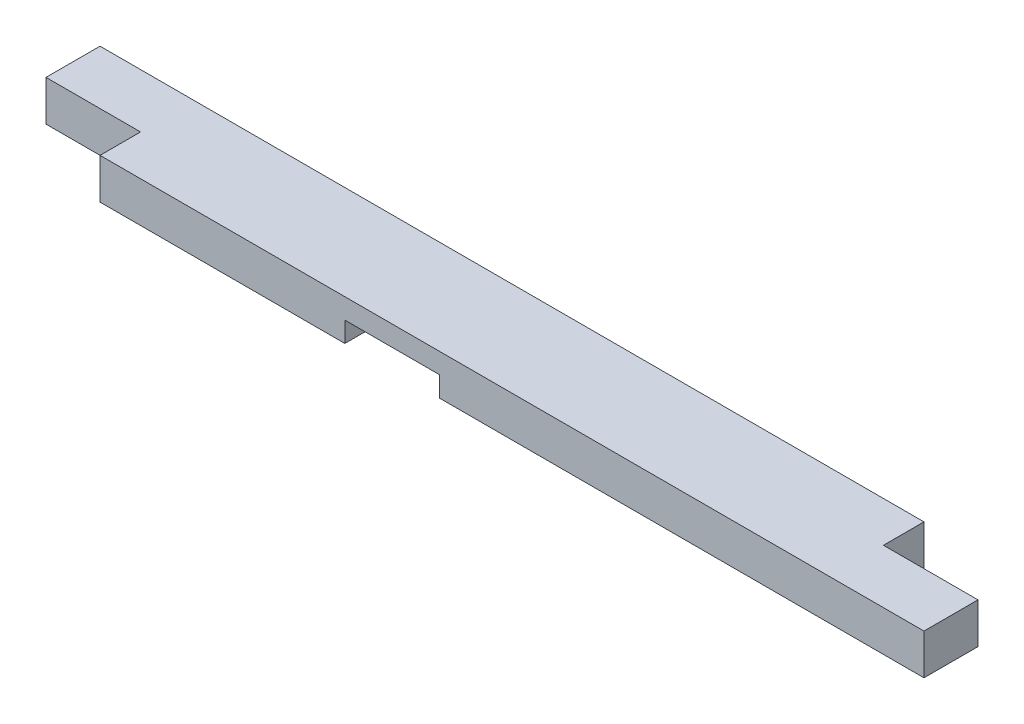
ISO-10303-21;
HEADER;
FILE_DESCRIPTION(('STEP AP214'),'2;1');
FILE_NAME('part.step','',(''),(''),'','','');
FILE_SCHEMA(('AUTOMOTIVE_DESIGN { 1 0 10303 214 1 1 1 1 }'));
ENDSEC;
DATA;
#1=APPLICATION_CONTEXT('core data for automotive mechanical design processes');
#2=APPLICATION_PROTOCOL_DEFINITION('international standard','automotive_design',2000,#1);
#3=PRODUCT_CONTEXT('',#1,'mechanical');
#4=PRODUCT('Part','Part','',(#3));
#5=PRODUCT_RELATED_PRODUCT_CATEGORY('part','',(#4));
#6=PRODUCT_DEFINITION_FORMATION('','',#4);
#7=PRODUCT_DEFINITION_CONTEXT('part definition',#1,'design');
#8=PRODUCT_DEFINITION('design','',#6,#7);
#9=PRODUCT_DEFINITION_SHAPE('','',#8);
#10=(LENGTH_UNIT() NAMED_UNIT(*) SI_UNIT(.MILLI.,.METRE.));
#11=(NAMED_UNIT(*) PLANE_ANGLE_UNIT() SI_UNIT($,.RADIAN.));
#12=(NAMED_UNIT(*) SI_UNIT($,.STERADIAN.) SOLID_ANGLE_UNIT());
#13=UNCERTAINTY_MEASURE_WITH_UNIT(LENGTH_MEASURE(1.E-05),#10,'distance_accuracy_value','');
#14=(GEOMETRIC_REPRESENTATION_CONTEXT(3) GLOBAL_UNCERTAINTY_ASSIGNED_CONTEXT((#13)) GLOBAL_UNIT_ASSIGNED_CONTEXT((#10,
#11,#12)) REPRESENTATION_CONTEXT('',''));
#15=CARTESIAN_POINT('',(0.,0.,0.));
#16=DIRECTION('',(0.,0.,1.));
#17=DIRECTION('',(1.,0.,0.));
#18=AXIS2_PLACEMENT_3D('',#15,#16,#17);
#19=CARTESIAN_POINT('',(0.,0.,0.));
#20=DIRECTION('',(0.,-1.,0.));
#21=DIRECTION('',(0.,0.,-1.));
#22=AXIS2_PLACEMENT_3D('',#19,#20,#21);
#23=PLANE('',#22);
#24=DIRECTION('',(-1.,0.,0.));
#25=VECTOR('',#24,1.);
#26=CARTESIAN_POINT('',(0.,0.,-38.1));
#27=LINE('',#26,#25);
#28=CARTESIAN_POINT('',(88.9,0.,-38.1));
#29=VERTEX_POINT('',#28);
#30=CARTESIAN_POINT('',(0.,0.,-38.1));
#31=VERTEX_POINT('',#30);
#32=EDGE_CURVE('E160',#29,#31,#27,.T.);
#33=ORIENTED_EDGE('',*,*,#32,.T.);
#34=DIRECTION('',(0.,0.,1.));
#35=VECTOR('',#34,1.);
#36=CARTESIAN_POINT('',(0.,0.,0.));
#37=LINE('',#36,#35);
#38=CARTESIAN_POINT('',(0.,0.,-88.9));
#39=VERTEX_POINT('',#38);
#40=EDGE_CURVE('E192',#39,#31,#37,.T.);
#41=ORIENTED_EDGE('',*,*,#40,.F.);
#42=DIRECTION('',(-1.,0.,0.));
#43=VECTOR('',#42,1.);
#44=CARTESIAN_POINT('',(0.,0.,-88.9));
#45=LINE('',#44,#43);
#46=CARTESIAN_POINT('',(319.0875,0.,-88.9));
#47=VERTEX_POINT('',#46);
#48=EDGE_CURVE('E218',#47,#39,#45,.T.);
#49=ORIENTED_EDGE('',*,*,#48,.F.);
#50=DIRECTION('',(0.,0.,-1.));
#51=VECTOR('',#50,1.);
#52=CARTESIAN_POINT('',(319.0875,0.,0.));
#53=LINE('',#52,#51);
#54=CARTESIAN_POINT('',(319.0875,0.,0.));
#55=VERTEX_POINT('',#54);
#56=EDGE_CURVE('E169',#55,#47,#53,.T.);
#57=ORIENTED_EDGE('',*,*,#56,.F.);
#58=DIRECTION('',(1.,0.,0.));
#59=VECTOR('',#58,1.);
#60=CARTESIAN_POINT('',(0.,0.,0.));
#61=LINE('',#60,#59);
#62=CARTESIAN_POINT('',(88.9,0.,0.));
#63=VERTEX_POINT('',#62);
#64=EDGE_CURVE('E214',#63,#55,#61,.T.);
#65=ORIENTED_EDGE('',*,*,#64,.F.);
#66=DIRECTION('',(0.,0.,-1.));
#67=VECTOR('',#66,1.);
#68=CARTESIAN_POINT('',(88.9,0.,0.));
#69=LINE('',#68,#67);
#70=EDGE_CURVE('E157',#63,#29,#69,.T.);
#71=ORIENTED_EDGE('',*,*,#70,.T.);
#72=EDGE_LOOP('',(#33,#41,#49,#57,#65,#71));
#73=FACE_BOUND('',#72,.T.);
#74=ADVANCED_FACE('F39',(#73),#23,.T.);
#75=CARTESIAN_POINT('',(0.,38.1,0.));
#76=DIRECTION('',(1.,0.,0.));
#77=DIRECTION('',(0.,0.,-1.));
#78=AXIS2_PLACEMENT_3D('',#75,#76,#77);
#79=PLANE('',#78);
#80=ORIENTED_EDGE('',*,*,#40,.T.);
#81=DIRECTION('',(0.,1.,0.));
#82=VECTOR('',#81,1.);
#83=CARTESIAN_POINT('',(0.,0.,-38.1));
#84=LINE('',#83,#82);
#85=CARTESIAN_POINT('',(0.,38.1,-38.1));
#86=VERTEX_POINT('',#85);
#87=EDGE_CURVE('E166',#31,#86,#84,.T.);
#88=ORIENTED_EDGE('',*,*,#87,.T.);
#89=DIRECTION('',(0.,0.,1.));
#90=VECTOR('',#89,1.);
#91=CARTESIAN_POINT('',(0.,38.1,0.));
#92=LINE('',#91,#90);
#93=CARTESIAN_POINT('',(0.,38.1,-88.9));
#94=VERTEX_POINT('',#93);
#95=EDGE_CURVE('E201',#94,#86,#92,.T.);
#96=ORIENTED_EDGE('',*,*,#95,.F.);
#97=DIRECTION('',(0.,-1.,0.));
#98=VECTOR('',#97,1.);
#99=CARTESIAN_POINT('',(0.,38.1,-88.9));
#100=LINE('',#99,#98);
#101=EDGE_CURVE('E47',#94,#39,#100,.T.);
#102=ORIENTED_EDGE('',*,*,#101,.T.);
#103=EDGE_LOOP('',(#80,#88,#96,#102));
#104=FACE_BOUND('',#103,.T.);
#105=ADVANCED_FACE('F41',(#104),#79,.F.);
#106=CARTESIAN_POINT('',(0.,38.1,0.));
#107=DIRECTION('',(0.,0.,-1.));
#108=DIRECTION('',(-1.,0.,0.));
#109=AXIS2_PLACEMENT_3D('',#106,#107,#108);
#110=PLANE('',#109);
#111=DIRECTION('',(1.,0.,0.));
#112=VECTOR('',#111,1.);
#113=CARTESIAN_POINT('',(0.,38.1,0.));
#114=LINE('',#113,#112);
#115=CARTESIAN_POINT('',(88.9,38.1,0.));
#116=VERTEX_POINT('',#115);
#117=CARTESIAN_POINT('',(863.6,38.1,0.));
#118=VERTEX_POINT('',#117);
#119=EDGE_CURVE('E204',#116,#118,#114,.T.);
#120=ORIENTED_EDGE('',*,*,#119,.F.);
#121=DIRECTION('',(0.,1.,0.));
#122=VECTOR('',#121,1.);
#123=CARTESIAN_POINT('',(88.9,0.,0.));
#124=LINE('',#123,#122);
#125=EDGE_CURVE('E62',#63,#116,#124,.T.);
#126=ORIENTED_EDGE('',*,*,#125,.F.);
#127=ORIENTED_EDGE('',*,*,#64,.T.);
#128=DIRECTION('',(0.,-1.,0.));
#129=VECTOR('',#128,1.);
#130=CARTESIAN_POINT('',(319.0875,19.05,0.));
#131=LINE('',#130,#129);
#132=CARTESIAN_POINT('',(319.0875,19.05,0.));
#133=VERTEX_POINT('',#132);
#134=EDGE_CURVE('E189',#133,#55,#131,.T.);
#135=ORIENTED_EDGE('',*,*,#134,.F.);
#136=DIRECTION('',(-1.,0.,0.));
#137=VECTOR('',#136,1.);
#138=CARTESIAN_POINT('',(319.0875,19.05,0.));
#139=LINE('',#138,#137);
#140=CARTESIAN_POINT('',(407.9875,19.05,0.));
#141=VERTEX_POINT('',#140);
#142=EDGE_CURVE('E183',#141,#133,#139,.T.);
#143=ORIENTED_EDGE('',*,*,#142,.F.);
#144=DIRECTION('',(0.,-1.,0.));
#145=VECTOR('',#144,1.);
#146=CARTESIAN_POINT('',(407.9875,19.05,0.));
#147=LINE('',#146,#145);
#148=CARTESIAN_POINT('',(407.9875,0.,0.));
#149=VERTEX_POINT('',#148);
#150=EDGE_CURVE('E193',#141,#149,#147,.T.);
#151=ORIENTED_EDGE('',*,*,#150,.T.);
#152=CARTESIAN_POINT('',(863.6,0.,0.));
#153=VERTEX_POINT('',#152);
#154=EDGE_CURVE('E213',#149,#153,#61,.T.);
#155=ORIENTED_EDGE('',*,*,#154,.T.);
#156=DIRECTION('',(0.,-1.,0.));
#157=VECTOR('',#156,1.);
#158=CARTESIAN_POINT('',(863.6,38.1,0.));
#159=LINE('',#158,#157);
#160=EDGE_CURVE('E11',#118,#153,#159,.T.);
#161=ORIENTED_EDGE('',*,*,#160,.F.);
#162=EDGE_LOOP('',(#120,#126,#127,#135,#143,#151,#155,#161));
#163=FACE_BOUND('',#162,.T.);
#164=ADVANCED_FACE('F245',(#163),#110,.F.);
#165=CARTESIAN_POINT('',(863.6,38.1,0.));
#166=DIRECTION('',(-1.,0.,0.));
#167=DIRECTION('',(0.,0.,1.));
#168=AXIS2_PLACEMENT_3D('',#165,#166,#167);
#169=PLANE('',#168);
#170=DIRECTION('',(0.,0.,-1.));
#171=VECTOR('',#170,1.);
#172=CARTESIAN_POINT('',(863.6,0.,0.));
#173=LINE('',#172,#171);
#174=CARTESIAN_POINT('',(863.6,0.,-50.8));
#175=VERTEX_POINT('',#174);
#176=EDGE_CURVE('E216',#153,#175,#173,.T.);
#177=ORIENTED_EDGE('',*,*,#176,.T.);
#178=DIRECTION('',(0.,1.,0.));
#179=VECTOR('',#178,1.);
#180=CARTESIAN_POINT('',(863.6,0.,-50.8));
#181=LINE('',#180,#179);
#182=CARTESIAN_POINT('',(863.6,38.1,-50.8));
#183=VERTEX_POINT('',#182);
#184=EDGE_CURVE('E54',#175,#183,#181,.T.);
#185=ORIENTED_EDGE('',*,*,#184,.T.);
#186=DIRECTION('',(0.,0.,-1.));
#187=VECTOR('',#186,1.);
#188=CARTESIAN_POINT('',(863.6,38.1,0.));
#189=LINE('',#188,#187);
#190=EDGE_CURVE('E206',#118,#183,#189,.T.);
#191=ORIENTED_EDGE('',*,*,#190,.F.);
#192=ORIENTED_EDGE('',*,*,#160,.T.);
#193=EDGE_LOOP('',(#177,#185,#191,#192));
#194=FACE_BOUND('',#193,.T.);
#195=ADVANCED_FACE('F249',(#194),#169,.F.);
#196=CARTESIAN_POINT('',(0.,38.1,-88.9));
#197=DIRECTION('',(0.,0.,1.));
#198=DIRECTION('',(1.,0.,0.));
#199=AXIS2_PLACEMENT_3D('',#196,#197,#198);
#200=PLANE('',#199);
#201=DIRECTION('',(-1.,0.,0.));
#202=VECTOR('',#201,1.);
#203=CARTESIAN_POINT('',(0.,38.1,-88.9));
#204=LINE('',#203,#202);
#205=CARTESIAN_POINT('',(774.7,38.1,-88.9));
#206=VERTEX_POINT('',#205);
#207=EDGE_CURVE('E209',#206,#94,#204,.T.);
#208=ORIENTED_EDGE('',*,*,#207,.F.);
#209=DIRECTION('',(0.,1.,0.));
#210=VECTOR('',#209,1.);
#211=CARTESIAN_POINT('',(774.7,0.,-88.9));
#212=LINE('',#211,#210);
#213=CARTESIAN_POINT('',(774.7,0.,-88.9));
#214=VERTEX_POINT('',#213);
#215=EDGE_CURVE('E153',#214,#206,#212,.T.);
#216=ORIENTED_EDGE('',*,*,#215,.F.);
#217=CARTESIAN_POINT('',(407.9875,0.,-88.9));
#218=VERTEX_POINT('',#217);
#219=EDGE_CURVE('E147',#214,#218,#45,.T.);
#220=ORIENTED_EDGE('',*,*,#219,.T.);
#221=DIRECTION('',(0.,-1.,0.));
#222=VECTOR('',#221,1.);
#223=CARTESIAN_POINT('',(407.9875,19.05,-88.9));
#224=LINE('',#223,#222);
#225=CARTESIAN_POINT('',(407.9875,19.05,-88.9));
#226=VERTEX_POINT('',#225);
#227=EDGE_CURVE('E196',#226,#218,#224,.T.);
#228=ORIENTED_EDGE('',*,*,#227,.F.);
#229=DIRECTION('',(1.,0.,0.));
#230=VECTOR('',#229,1.);
#231=CARTESIAN_POINT('',(319.0875,19.05,-88.9));
#232=LINE('',#231,#230);
#233=CARTESIAN_POINT('',(319.0875,19.05,-88.9));
#234=VERTEX_POINT('',#233);
#235=EDGE_CURVE('E176',#234,#226,#232,.T.);
#236=ORIENTED_EDGE('',*,*,#235,.F.);
#237=DIRECTION('',(0.,-1.,0.));
#238=VECTOR('',#237,1.);
#239=CARTESIAN_POINT('',(319.0875,19.05,-88.9));
#240=LINE('',#239,#238);
#241=EDGE_CURVE('E186',#234,#47,#240,.T.);
#242=ORIENTED_EDGE('',*,*,#241,.T.);
#243=ORIENTED_EDGE('',*,*,#48,.T.);
#244=ORIENTED_EDGE('',*,*,#101,.F.);
#245=EDGE_LOOP('',(#208,#216,#220,#228,#236,#242,#243,#244));
#246=FACE_BOUND('',#245,.T.);
#247=ADVANCED_FACE('F236',(#246),#200,.F.);
#248=CARTESIAN_POINT('',(0.,38.1,0.));
#249=DIRECTION('',(0.,-1.,0.));
#250=DIRECTION('',(0.,0.,-1.));
#251=AXIS2_PLACEMENT_3D('',#248,#249,#250);
#252=PLANE('',#251);
#253=DIRECTION('',(1.,0.,0.));
#254=VECTOR('',#253,1.);
#255=CARTESIAN_POINT('',(774.7,38.1,-50.8));
#256=LINE('',#255,#254);
#257=CARTESIAN_POINT('',(774.7,38.1,-50.8));
#258=VERTEX_POINT('',#257);
#259=EDGE_CURVE('E148',#258,#183,#256,.T.);
#260=ORIENTED_EDGE('',*,*,#259,.F.);
#261=DIRECTION('',(0.,0.,1.));
#262=VECTOR('',#261,1.);
#263=CARTESIAN_POINT('',(774.7,38.1,-88.9));
#264=LINE('',#263,#262);
#265=EDGE_CURVE('E135',#206,#258,#264,.T.);
#266=ORIENTED_EDGE('',*,*,#265,.F.);
#267=ORIENTED_EDGE('',*,*,#207,.T.);
#268=ORIENTED_EDGE('',*,*,#95,.T.);
#269=DIRECTION('',(-1.,0.,0.));
#270=VECTOR('',#269,1.);
#271=CARTESIAN_POINT('',(0.,38.1,-38.1));
#272=LINE('',#271,#270);
#273=CARTESIAN_POINT('',(88.9,38.1,-38.1));
#274=VERTEX_POINT('',#273);
#275=EDGE_CURVE('E161',#274,#86,#272,.T.);
#276=ORIENTED_EDGE('',*,*,#275,.F.);
#277=DIRECTION('',(0.,0.,-1.));
#278=VECTOR('',#277,1.);
#279=CARTESIAN_POINT('',(88.9,38.1,0.));
#280=LINE('',#279,#278);
#281=EDGE_CURVE('E155',#116,#274,#280,.T.);
#282=ORIENTED_EDGE('',*,*,#281,.F.);
#283=ORIENTED_EDGE('',*,*,#119,.T.);
#284=ORIENTED_EDGE('',*,*,#190,.T.);
#285=EDGE_LOOP('',(#260,#266,#267,#268,#276,#282,#283,#284));
#286=FACE_BOUND('',#285,.T.);
#287=ADVANCED_FACE('F235',(#286),#252,.F.);
#288=DIRECTION('',(0.,0.,1.));
#289=VECTOR('',#288,1.);
#290=CARTESIAN_POINT('',(774.7,0.,-88.9));
#291=LINE('',#290,#289);
#292=CARTESIAN_POINT('',(774.7,0.,-50.8));
#293=VERTEX_POINT('',#292);
#294=EDGE_CURVE('E132',#214,#293,#291,.T.);
#295=ORIENTED_EDGE('',*,*,#294,.T.);
#296=DIRECTION('',(1.,0.,0.));
#297=VECTOR('',#296,1.);
#298=CARTESIAN_POINT('',(774.7,0.,-50.8));
#299=LINE('',#298,#297);
#300=EDGE_CURVE('E137',#293,#175,#299,.T.);
#301=ORIENTED_EDGE('',*,*,#300,.T.);
#302=ORIENTED_EDGE('',*,*,#176,.F.);
#303=ORIENTED_EDGE('',*,*,#154,.F.);
#304=DIRECTION('',(0.,0.,1.));
#305=VECTOR('',#304,1.);
#306=CARTESIAN_POINT('',(407.9875,0.,0.));
#307=LINE('',#306,#305);
#308=EDGE_CURVE('E177',#218,#149,#307,.T.);
#309=ORIENTED_EDGE('',*,*,#308,.F.);
#310=ORIENTED_EDGE('',*,*,#219,.F.);
#311=EDGE_LOOP('',(#295,#301,#302,#303,#309,#310));
#312=FACE_BOUND('',#311,.T.);
#313=ADVANCED_FACE('F145',(#312),#23,.T.);
#314=CARTESIAN_POINT('',(319.0875,19.05,0.));
#315=DIRECTION('',(-1.,0.,0.));
#316=DIRECTION('',(0.,0.,1.));
#317=AXIS2_PLACEMENT_3D('',#314,#315,#316);
#318=PLANE('',#317);
#319=ORIENTED_EDGE('',*,*,#56,.T.);
#320=ORIENTED_EDGE('',*,*,#241,.F.);
#321=DIRECTION('',(0.,0.,-1.));
#322=VECTOR('',#321,1.);
#323=CARTESIAN_POINT('',(319.0875,19.05,0.));
#324=LINE('',#323,#322);
#325=EDGE_CURVE('E173',#133,#234,#324,.T.);
#326=ORIENTED_EDGE('',*,*,#325,.F.);
#327=ORIENTED_EDGE('',*,*,#134,.T.);
#328=EDGE_LOOP('',(#319,#320,#326,#327));
#329=FACE_BOUND('',#328,.T.);
#330=ADVANCED_FACE('F252',(#329),#318,.F.);
#331=CARTESIAN_POINT('',(407.9875,19.05,0.));
#332=DIRECTION('',(1.,0.,0.));
#333=DIRECTION('',(0.,0.,-1.));
#334=AXIS2_PLACEMENT_3D('',#331,#332,#333);
#335=PLANE('',#334);
#336=ORIENTED_EDGE('',*,*,#308,.T.);
#337=ORIENTED_EDGE('',*,*,#150,.F.);
#338=DIRECTION('',(0.,0.,1.));
#339=VECTOR('',#338,1.);
#340=CARTESIAN_POINT('',(407.9875,19.05,0.));
#341=LINE('',#340,#339);
#342=EDGE_CURVE('E180',#226,#141,#341,.T.);
#343=ORIENTED_EDGE('',*,*,#342,.F.);
#344=ORIENTED_EDGE('',*,*,#227,.T.);
#345=EDGE_LOOP('',(#336,#337,#343,#344));
#346=FACE_BOUND('',#345,.T.);
#347=ADVANCED_FACE('F240',(#346),#335,.F.);
#348=CARTESIAN_POINT('',(0.,19.05,0.));
#349=DIRECTION('',(0.,-1.,0.));
#350=DIRECTION('',(0.,0.,-1.));
#351=AXIS2_PLACEMENT_3D('',#348,#349,#350);
#352=PLANE('',#351);
#353=ORIENTED_EDGE('',*,*,#325,.T.);
#354=ORIENTED_EDGE('',*,*,#235,.T.);
#355=ORIENTED_EDGE('',*,*,#342,.T.);
#356=ORIENTED_EDGE('',*,*,#142,.T.);
#357=EDGE_LOOP('',(#353,#354,#355,#356));
#358=FACE_BOUND('',#357,.T.);
#359=ADVANCED_FACE('F254',(#358),#352,.T.);
#360=CARTESIAN_POINT('',(0.,0.,-38.1));
#361=DIRECTION('',(0.,0.,-1.));
#362=DIRECTION('',(-1.,0.,0.));
#363=AXIS2_PLACEMENT_3D('',#360,#361,#362);
#364=PLANE('',#363);
#365=ORIENTED_EDGE('',*,*,#275,.T.);
#366=ORIENTED_EDGE('',*,*,#87,.F.);
#367=ORIENTED_EDGE('',*,*,#32,.F.);
#368=DIRECTION('',(0.,1.,0.));
#369=VECTOR('',#368,1.);
#370=CARTESIAN_POINT('',(88.9,0.,-38.1));
#371=LINE('',#370,#369);
#372=EDGE_CURVE('E170',#29,#274,#371,.T.);
#373=ORIENTED_EDGE('',*,*,#372,.T.);
#374=EDGE_LOOP('',(#365,#366,#367,#373));
#375=FACE_BOUND('',#374,.T.);
#376=ADVANCED_FACE('F232',(#375),#364,.F.);
#377=CARTESIAN_POINT('',(88.9,0.,0.));
#378=DIRECTION('',(1.,0.,0.));
#379=DIRECTION('',(0.,0.,-1.));
#380=AXIS2_PLACEMENT_3D('',#377,#378,#379);
#381=PLANE('',#380);
#382=ORIENTED_EDGE('',*,*,#281,.T.);
#383=ORIENTED_EDGE('',*,*,#372,.F.);
#384=ORIENTED_EDGE('',*,*,#70,.F.);
#385=ORIENTED_EDGE('',*,*,#125,.T.);
#386=EDGE_LOOP('',(#382,#383,#384,#385));
#387=FACE_BOUND('',#386,.T.);
#388=ADVANCED_FACE('F262',(#387),#381,.F.);
#389=CARTESIAN_POINT('',(774.7,0.,-88.9));
#390=DIRECTION('',(-1.,0.,0.));
#391=DIRECTION('',(0.,0.,1.));
#392=AXIS2_PLACEMENT_3D('',#389,#390,#391);
#393=PLANE('',#392);
#394=ORIENTED_EDGE('',*,*,#265,.T.);
#395=DIRECTION('',(0.,1.,0.));
#396=VECTOR('',#395,1.);
#397=CARTESIAN_POINT('',(774.7,0.,-50.8));
#398=LINE('',#397,#396);
#399=EDGE_CURVE('E129',#293,#258,#398,.T.);
#400=ORIENTED_EDGE('',*,*,#399,.F.);
#401=ORIENTED_EDGE('',*,*,#294,.F.);
#402=ORIENTED_EDGE('',*,*,#215,.T.);
#403=EDGE_LOOP('',(#394,#400,#401,#402));
#404=FACE_BOUND('',#403,.T.);
#405=ADVANCED_FACE('F130',(#404),#393,.F.);
#406=CARTESIAN_POINT('',(774.7,0.,-50.8));
#407=DIRECTION('',(0.,0.,1.));
#408=DIRECTION('',(1.,0.,0.));
#409=AXIS2_PLACEMENT_3D('',#406,#407,#408);
#410=PLANE('',#409);
#411=ORIENTED_EDGE('',*,*,#259,.T.);
#412=ORIENTED_EDGE('',*,*,#184,.F.);
#413=ORIENTED_EDGE('',*,*,#300,.F.);
#414=ORIENTED_EDGE('',*,*,#399,.T.);
#415=EDGE_LOOP('',(#411,#412,#413,#414));
#416=FACE_BOUND('',#415,.T.);
#417=ADVANCED_FACE('F139',(#416),#410,.F.);
#418=CLOSED_SHELL('',(#74,#105,#164,#195,#247,#287,#313,#330,#347,#359,#376,#388,#405,#417));
#419=MANIFOLD_SOLID_BREP('B2',#418);
#420=ADVANCED_BREP_SHAPE_REPRESENTATION('',(#18,#419),#14);
#421=SHAPE_DEFINITION_REPRESENTATION(#9,#420);
ENDSEC;
END-ISO-10303-21;
